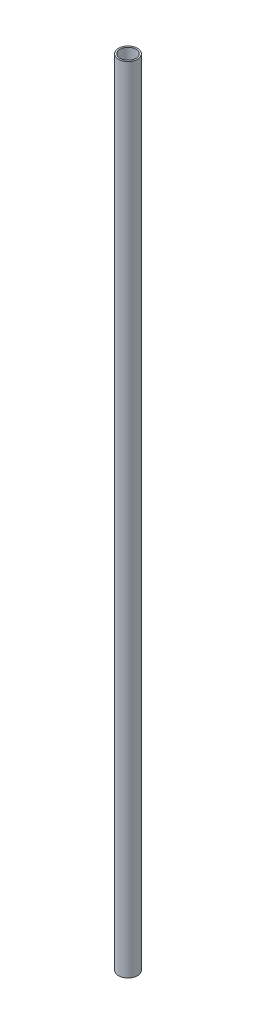
ISO-10303-21;
HEADER;
FILE_DESCRIPTION(('STEP AP214'),'2;1');
FILE_NAME('part.step','',(''),(''),'','','');
FILE_SCHEMA(('AUTOMOTIVE_DESIGN { 1 0 10303 214 1 1 1 1 }'));
ENDSEC;
DATA;
#1=APPLICATION_CONTEXT('core data for automotive mechanical design processes');
#2=APPLICATION_PROTOCOL_DEFINITION('international standard','automotive_design',2000,#1);
#3=PRODUCT_CONTEXT('',#1,'mechanical');
#4=PRODUCT('Part','Part','',(#3));
#5=PRODUCT_RELATED_PRODUCT_CATEGORY('part','',(#4));
#6=PRODUCT_DEFINITION_FORMATION('','',#4);
#7=PRODUCT_DEFINITION_CONTEXT('part definition',#1,'design');
#8=PRODUCT_DEFINITION('design','',#6,#7);
#9=PRODUCT_DEFINITION_SHAPE('','',#8);
#10=(LENGTH_UNIT() NAMED_UNIT(*) SI_UNIT(.MILLI.,.METRE.));
#11=(NAMED_UNIT(*) PLANE_ANGLE_UNIT() SI_UNIT($,.RADIAN.));
#12=(NAMED_UNIT(*) SI_UNIT($,.STERADIAN.) SOLID_ANGLE_UNIT());
#13=UNCERTAINTY_MEASURE_WITH_UNIT(LENGTH_MEASURE(1.E-05),#10,'distance_accuracy_value','');
#14=(GEOMETRIC_REPRESENTATION_CONTEXT(3) GLOBAL_UNCERTAINTY_ASSIGNED_CONTEXT((#13)) GLOBAL_UNIT_ASSIGNED_CONTEXT((#10,
#11,#12)) REPRESENTATION_CONTEXT('',''));
#15=CARTESIAN_POINT('',(0.,0.,0.));
#16=DIRECTION('',(0.,0.,1.));
#17=DIRECTION('',(1.,0.,0.));
#18=AXIS2_PLACEMENT_3D('',#15,#16,#17);
#19=CARTESIAN_POINT('',(0.,500.,0.));
#20=DIRECTION('',(0.,1.,0.));
#21=DIRECTION('',(0.,0.,1.));
#22=AXIS2_PLACEMENT_3D('',#19,#20,#21);
#23=PLANE('',#22);
#24=CARTESIAN_POINT('',(0.,500.,0.));
#25=DIRECTION('',(0.,1.,0.));
#26=DIRECTION('',(0.,0.,1.));
#27=AXIS2_PLACEMENT_3D('',#24,#25,#26);
#28=CIRCLE('',#27,6.);
#29=CARTESIAN_POINT('',(0.,500.,6.));
#30=VERTEX_POINT('',#29);
#31=EDGE_CURVE('E10',#30,#30,#28,.T.);
#32=ORIENTED_EDGE('',*,*,#31,.T.);
#33=EDGE_LOOP('',(#32));
#34=FACE_BOUND('',#33,.T.);
#35=CARTESIAN_POINT('',(0.,500.,0.));
#36=DIRECTION('',(0.,1.,0.));
#37=DIRECTION('',(0.,0.,1.));
#38=AXIS2_PLACEMENT_3D('',#35,#36,#37);
#39=CIRCLE('',#38,5.);
#40=CARTESIAN_POINT('',(0.,500.,5.));
#41=VERTEX_POINT('',#40);
#42=EDGE_CURVE('E50',#41,#41,#39,.T.);
#43=ORIENTED_EDGE('',*,*,#42,.F.);
#44=EDGE_LOOP('',(#43));
#45=FACE_BOUND('',#44,.T.);
#46=ADVANCED_FACE('F37',(#34,#45),#23,.T.);
#47=CARTESIAN_POINT('',(0.,0.,0.));
#48=DIRECTION('',(0.,1.,0.));
#49=DIRECTION('',(0.,0.,1.));
#50=AXIS2_PLACEMENT_3D('',#47,#48,#49);
#51=PLANE('',#50);
#52=CARTESIAN_POINT('',(0.,0.,0.));
#53=DIRECTION('',(0.,1.,0.));
#54=DIRECTION('',(0.,0.,1.));
#55=AXIS2_PLACEMENT_3D('',#52,#53,#54);
#56=CIRCLE('',#55,6.);
#57=CARTESIAN_POINT('',(0.,0.,6.));
#58=VERTEX_POINT('',#57);
#59=EDGE_CURVE('E41',#58,#58,#56,.T.);
#60=ORIENTED_EDGE('',*,*,#59,.F.);
#61=EDGE_LOOP('',(#60));
#62=FACE_BOUND('',#61,.T.);
#63=CARTESIAN_POINT('',(0.,0.,0.));
#64=DIRECTION('',(0.,1.,0.));
#65=DIRECTION('',(0.,0.,1.));
#66=AXIS2_PLACEMENT_3D('',#63,#64,#65);
#67=CIRCLE('',#66,5.);
#68=CARTESIAN_POINT('',(0.,0.,5.));
#69=VERTEX_POINT('',#68);
#70=EDGE_CURVE('E52',#69,#69,#67,.T.);
#71=ORIENTED_EDGE('',*,*,#70,.T.);
#72=EDGE_LOOP('',(#71));
#73=FACE_BOUND('',#72,.T.);
#74=ADVANCED_FACE('F64',(#62,#73),#51,.F.);
#75=CARTESIAN_POINT('',(0.,500.,0.));
#76=DIRECTION('',(0.,-1.,0.));
#77=DIRECTION('',(0.,0.,-1.));
#78=AXIS2_PLACEMENT_3D('',#75,#76,#77);
#79=CYLINDRICAL_SURFACE('',#78,6.);
#80=ORIENTED_EDGE('',*,*,#31,.F.);
#81=EDGE_LOOP('',(#80));
#82=FACE_BOUND('',#81,.T.);
#83=ORIENTED_EDGE('',*,*,#59,.T.);
#84=EDGE_LOOP('',(#83));
#85=FACE_BOUND('',#84,.T.);
#86=ADVANCED_FACE('F39',(#82,#85),#79,.T.);
#87=CARTESIAN_POINT('',(0.,500.,0.));
#88=DIRECTION('',(0.,-1.,0.));
#89=DIRECTION('',(0.,0.,-1.));
#90=AXIS2_PLACEMENT_3D('',#87,#88,#89);
#91=CYLINDRICAL_SURFACE('',#90,5.);
#92=ORIENTED_EDGE('',*,*,#42,.T.);
#93=EDGE_LOOP('',(#92));
#94=FACE_BOUND('',#93,.T.);
#95=ORIENTED_EDGE('',*,*,#70,.F.);
#96=EDGE_LOOP('',(#95));
#97=FACE_BOUND('',#96,.T.);
#98=ADVANCED_FACE('F60',(#94,#97),#91,.F.);
#99=CLOSED_SHELL('',(#46,#74,#86,#98));
#100=MANIFOLD_SOLID_BREP('B2',#99);
#101=ADVANCED_BREP_SHAPE_REPRESENTATION('',(#18,#100),#14);
#102=SHAPE_DEFINITION_REPRESENTATION(#9,#101);
ENDSEC;
END-ISO-10303-21;
